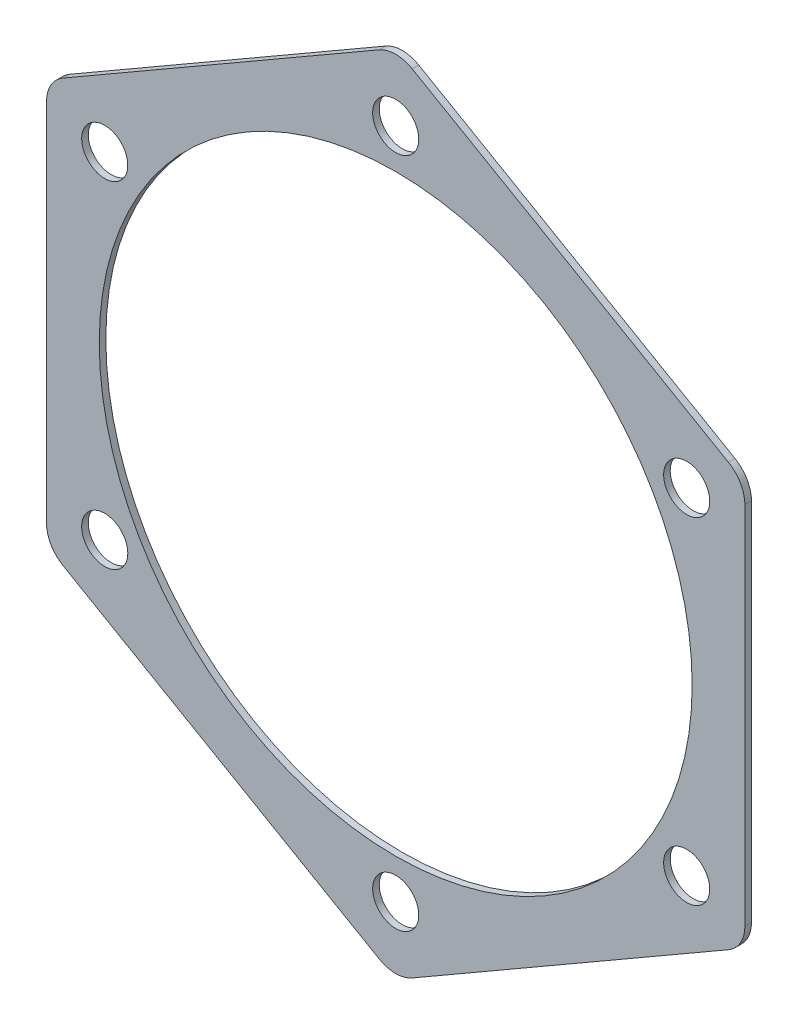
ISO-10303-21;
HEADER;
FILE_DESCRIPTION(('STEP AP214'),'2;1');
FILE_NAME('part.step','',(''),(''),'','','');
FILE_SCHEMA(('AUTOMOTIVE_DESIGN { 1 0 10303 214 1 1 1 1 }'));
ENDSEC;
DATA;
#1=APPLICATION_CONTEXT('core data for automotive mechanical design processes');
#2=APPLICATION_PROTOCOL_DEFINITION('international standard','automotive_design',2000,#1);
#3=PRODUCT_CONTEXT('',#1,'mechanical');
#4=PRODUCT('Part','Part','',(#3));
#5=PRODUCT_RELATED_PRODUCT_CATEGORY('part','',(#4));
#6=PRODUCT_DEFINITION_FORMATION('','',#4);
#7=PRODUCT_DEFINITION_CONTEXT('part definition',#1,'design');
#8=PRODUCT_DEFINITION('design','',#6,#7);
#9=PRODUCT_DEFINITION_SHAPE('','',#8);
#10=(LENGTH_UNIT() NAMED_UNIT(*) SI_UNIT(.MILLI.,.METRE.));
#11=(NAMED_UNIT(*) PLANE_ANGLE_UNIT() SI_UNIT($,.RADIAN.));
#12=(NAMED_UNIT(*) SI_UNIT($,.STERADIAN.) SOLID_ANGLE_UNIT());
#13=UNCERTAINTY_MEASURE_WITH_UNIT(LENGTH_MEASURE(1.E-05),#10,'distance_accuracy_value','');
#14=(GEOMETRIC_REPRESENTATION_CONTEXT(3) GLOBAL_UNCERTAINTY_ASSIGNED_CONTEXT((#13)) GLOBAL_UNIT_ASSIGNED_CONTEXT((#10,
#11,#12)) REPRESENTATION_CONTEXT('',''));
#15=CARTESIAN_POINT('',(0.,0.,0.));
#16=DIRECTION('',(0.,0.,1.));
#17=DIRECTION('',(1.,0.,0.));
#18=AXIS2_PLACEMENT_3D('',#15,#16,#17);
#19=CARTESIAN_POINT('',(52.9999999999997,30.5995642670508,0.5));
#20=DIRECTION('',(-0.499999999999995,-0.866025403784442,0.));
#21=DIRECTION('',(0.866025403784442,-0.499999999999995,0.));
#22=AXIS2_PLACEMENT_3D('',#19,#20,#21);
#23=PLANE('',#22);
#24=DIRECTION('',(-0.866025403784442,0.499999999999995,0.));
#25=VECTOR('',#24,1.);
#26=CARTESIAN_POINT('',(52.9999999999997,30.5995642670508,0.5));
#27=LINE('',#26,#25);
#28=CARTESIAN_POINT('',(50.4999999999997,32.0429399400248,0.5));
#29=VERTEX_POINT('',#28);
#30=CARTESIAN_POINT('',(2.49999999999998,59.7557528611263,0.5));
#31=VERTEX_POINT('',#30);
#32=EDGE_CURVE('E154',#29,#31,#27,.T.);
#33=ORIENTED_EDGE('',*,*,#32,.F.);
#34=DIRECTION('',(0.,0.,-1.));
#35=VECTOR('',#34,1.);
#36=CARTESIAN_POINT('',(50.4999999999997,32.0429399400248,0.5));
#37=LINE('',#36,#35);
#38=CARTESIAN_POINT('',(50.4999999999997,32.0429399400248,-0.5));
#39=VERTEX_POINT('',#38);
#40=EDGE_CURVE('E138',#29,#39,#37,.T.);
#41=ORIENTED_EDGE('',*,*,#40,.T.);
#42=DIRECTION('',(-0.866025403784442,0.499999999999995,0.));
#43=VECTOR('',#42,1.);
#44=CARTESIAN_POINT('',(52.9999999999997,30.5995642670508,-0.5));
#45=LINE('',#44,#43);
#46=CARTESIAN_POINT('',(2.49999999999998,59.7557528611263,-0.5));
#47=VERTEX_POINT('',#46);
#48=EDGE_CURVE('E151',#39,#47,#45,.T.);
#49=ORIENTED_EDGE('',*,*,#48,.T.);
#50=DIRECTION('',(0.,0.,-1.));
#51=VECTOR('',#50,1.);
#52=CARTESIAN_POINT('',(2.49999999999999,59.7557528611263,0.5));
#53=LINE('',#52,#51);
#54=EDGE_CURVE('E157',#47,#31,#53,.F.);
#55=ORIENTED_EDGE('',*,*,#54,.T.);
#56=EDGE_LOOP('',(#33,#41,#49,#55));
#57=FACE_BOUND('',#56,.T.);
#58=ADVANCED_FACE('F43',(#57),#23,.F.);
#59=CARTESIAN_POINT('',(0.,61.1991285341004,0.5));
#60=DIRECTION('',(0.500000000000001,-0.866025403784438,0.));
#61=DIRECTION('',(0.866025403784438,0.500000000000001,0.));
#62=AXIS2_PLACEMENT_3D('',#59,#60,#61);
#63=PLANE('',#62);
#64=DIRECTION('',(-0.866025403784438,-0.500000000000001,0.));
#65=VECTOR('',#64,1.);
#66=CARTESIAN_POINT('',(0.,61.1991285341004,-0.5));
#67=LINE('',#66,#65);
#68=CARTESIAN_POINT('',(-2.49999999999998,59.7557528611263,-0.5));
#69=VERTEX_POINT('',#68);
#70=CARTESIAN_POINT('',(-50.5000000000001,32.0429399400241,-0.5));
#71=VERTEX_POINT('',#70);
#72=EDGE_CURVE('E162',#69,#71,#67,.T.);
#73=ORIENTED_EDGE('',*,*,#72,.T.);
#74=DIRECTION('',(0.,0.,-1.));
#75=VECTOR('',#74,1.);
#76=CARTESIAN_POINT('',(-50.5000000000001,32.0429399400241,0.5));
#77=LINE('',#76,#75);
#78=CARTESIAN_POINT('',(-50.5000000000001,32.0429399400241,0.5));
#79=VERTEX_POINT('',#78);
#80=EDGE_CURVE('E11',#71,#79,#77,.F.);
#81=ORIENTED_EDGE('',*,*,#80,.T.);
#82=DIRECTION('',(-0.866025403784438,-0.500000000000001,0.));
#83=VECTOR('',#82,1.);
#84=CARTESIAN_POINT('',(0.,61.1991285341004,0.5));
#85=LINE('',#84,#83);
#86=CARTESIAN_POINT('',(-2.49999999999998,59.7557528611263,0.5));
#87=VERTEX_POINT('',#86);
#88=EDGE_CURVE('E256',#87,#79,#85,.T.);
#89=ORIENTED_EDGE('',*,*,#88,.F.);
#90=DIRECTION('',(0.,0.,-1.));
#91=VECTOR('',#90,1.);
#92=CARTESIAN_POINT('',(-2.49999999999998,59.7557528611263,0.5));
#93=LINE('',#92,#91);
#94=EDGE_CURVE('E52',#87,#69,#93,.T.);
#95=ORIENTED_EDGE('',*,*,#94,.T.);
#96=EDGE_LOOP('',(#73,#81,#89,#95));
#97=FACE_BOUND('',#96,.T.);
#98=ADVANCED_FACE('F253',(#97),#63,.F.);
#99=CARTESIAN_POINT('',(-53.0000000000001,30.5995642670501,0.5));
#100=DIRECTION('',(1.,0.,0.));
#101=DIRECTION('',(0.,1.,0.));
#102=AXIS2_PLACEMENT_3D('',#99,#100,#101);
#103=PLANE('',#102);
#104=DIRECTION('',(0.,-1.,0.));
#105=VECTOR('',#104,1.);
#106=CARTESIAN_POINT('',(-53.0000000000001,30.5995642670501,-0.5));
#107=LINE('',#106,#105);
#108=CARTESIAN_POINT('',(-53.0000000000001,27.7128129211019,-0.5));
#109=VERTEX_POINT('',#108);
#110=CARTESIAN_POINT('',(-52.9999999999999,-27.7128129211023,-0.5));
#111=VERTEX_POINT('',#110);
#112=EDGE_CURVE('E169',#109,#111,#107,.T.);
#113=ORIENTED_EDGE('',*,*,#112,.T.);
#114=DIRECTION('',(0.,0.,-1.));
#115=VECTOR('',#114,1.);
#116=CARTESIAN_POINT('',(-52.9999999999999,-27.7128129211023,0.5));
#117=LINE('',#116,#115);
#118=CARTESIAN_POINT('',(-52.9999999999999,-27.7128129211023,0.5));
#119=VERTEX_POINT('',#118);
#120=EDGE_CURVE('E245',#111,#119,#117,.F.);
#121=ORIENTED_EDGE('',*,*,#120,.T.);
#122=DIRECTION('',(0.,-1.,0.));
#123=VECTOR('',#122,1.);
#124=CARTESIAN_POINT('',(-53.0000000000001,30.5995642670501,0.5));
#125=LINE('',#124,#123);
#126=CARTESIAN_POINT('',(-53.0000000000001,27.7128129211019,0.5));
#127=VERTEX_POINT('',#126);
#128=EDGE_CURVE('E269',#127,#119,#125,.T.);
#129=ORIENTED_EDGE('',*,*,#128,.F.);
#130=DIRECTION('',(0.,0.,-1.));
#131=VECTOR('',#130,1.);
#132=CARTESIAN_POINT('',(-53.0000000000001,27.7128129211019,0.5));
#133=LINE('',#132,#131);
#134=EDGE_CURVE('E241',#127,#109,#133,.T.);
#135=ORIENTED_EDGE('',*,*,#134,.T.);
#136=EDGE_LOOP('',(#113,#121,#129,#135));
#137=FACE_BOUND('',#136,.T.);
#138=ADVANCED_FACE('F266',(#137),#103,.F.);
#139=CARTESIAN_POINT('',(-52.9999999999999,-30.5995642670504,0.5));
#140=DIRECTION('',(0.499999999999995,0.866025403784441,0.));
#141=DIRECTION('',(-0.866025403784442,0.499999999999995,0.));
#142=AXIS2_PLACEMENT_3D('',#139,#140,#141);
#143=PLANE('',#142);
#144=DIRECTION('',(0.866025403784441,-0.499999999999995,0.));
#145=VECTOR('',#144,1.);
#146=CARTESIAN_POINT('',(-52.9999999999999,-30.5995642670504,-0.5));
#147=LINE('',#146,#145);
#148=CARTESIAN_POINT('',(-50.4999999999999,-32.0429399400245,-0.5));
#149=VERTEX_POINT('',#148);
#150=CARTESIAN_POINT('',(-2.49999999999959,-59.7557528611263,-0.5));
#151=VERTEX_POINT('',#150);
#152=EDGE_CURVE('E181',#149,#151,#147,.T.);
#153=ORIENTED_EDGE('',*,*,#152,.T.);
#154=DIRECTION('',(0.,0.,-1.));
#155=VECTOR('',#154,1.);
#156=CARTESIAN_POINT('',(-2.49999999999958,-59.7557528611263,0.5));
#157=LINE('',#156,#155);
#158=CARTESIAN_POINT('',(-2.49999999999959,-59.7557528611263,0.5));
#159=VERTEX_POINT('',#158);
#160=EDGE_CURVE('E238',#151,#159,#157,.F.);
#161=ORIENTED_EDGE('',*,*,#160,.T.);
#162=DIRECTION('',(0.866025403784441,-0.499999999999995,0.));
#163=VECTOR('',#162,1.);
#164=CARTESIAN_POINT('',(-52.9999999999999,-30.5995642670504,0.5));
#165=LINE('',#164,#163);
#166=CARTESIAN_POINT('',(-50.4999999999999,-32.0429399400245,0.5));
#167=VERTEX_POINT('',#166);
#168=EDGE_CURVE('E272',#167,#159,#165,.T.);
#169=ORIENTED_EDGE('',*,*,#168,.F.);
#170=DIRECTION('',(0.,0.,-1.));
#171=VECTOR('',#170,1.);
#172=CARTESIAN_POINT('',(-50.4999999999999,-32.0429399400245,0.5));
#173=LINE('',#172,#171);
#174=EDGE_CURVE('E234',#167,#149,#173,.T.);
#175=ORIENTED_EDGE('',*,*,#174,.T.);
#176=EDGE_LOOP('',(#153,#161,#169,#175));
#177=FACE_BOUND('',#176,.T.);
#178=ADVANCED_FACE('F302',(#177),#143,.F.);
#179=CARTESIAN_POINT('',(4.27351230460548E-13,-61.1991285341004,0.5));
#180=DIRECTION('',(-0.500000000000007,0.866025403784434,0.));
#181=DIRECTION('',(-0.866025403784434,-0.500000000000007,0.));
#182=AXIS2_PLACEMENT_3D('',#179,#180,#181);
#183=PLANE('',#182);
#184=DIRECTION('',(0.866025403784434,0.500000000000007,0.));
#185=VECTOR('',#184,1.);
#186=CARTESIAN_POINT('',(4.27351230460548E-13,-61.1991285341004,-0.5));
#187=LINE('',#186,#185);
#188=CARTESIAN_POINT('',(2.50000000000042,-59.7557528611263,-0.5));
#189=VERTEX_POINT('',#188);
#190=CARTESIAN_POINT('',(50.5000000000003,-32.0429399400238,-0.5));
#191=VERTEX_POINT('',#190);
#192=EDGE_CURVE('E185',#189,#191,#187,.T.);
#193=ORIENTED_EDGE('',*,*,#192,.T.);
#194=DIRECTION('',(0.,0.,-1.));
#195=VECTOR('',#194,1.);
#196=CARTESIAN_POINT('',(50.5000000000003,-32.0429399400238,0.5));
#197=LINE('',#196,#195);
#198=CARTESIAN_POINT('',(50.5000000000003,-32.0429399400238,0.5));
#199=VERTEX_POINT('',#198);
#200=EDGE_CURVE('E59',#191,#199,#197,.F.);
#201=ORIENTED_EDGE('',*,*,#200,.T.);
#202=DIRECTION('',(0.866025403784434,0.500000000000007,0.));
#203=VECTOR('',#202,1.);
#204=CARTESIAN_POINT('',(4.27351230460548E-13,-61.1991285341004,0.5));
#205=LINE('',#204,#203);
#206=CARTESIAN_POINT('',(2.50000000000042,-59.7557528611263,0.5));
#207=VERTEX_POINT('',#206);
#208=EDGE_CURVE('E277',#207,#199,#205,.T.);
#209=ORIENTED_EDGE('',*,*,#208,.F.);
#210=DIRECTION('',(0.,0.,-1.));
#211=VECTOR('',#210,1.);
#212=CARTESIAN_POINT('',(2.50000000000042,-59.7557528611263,0.5));
#213=LINE('',#212,#211);
#214=EDGE_CURVE('E228',#207,#189,#213,.T.);
#215=ORIENTED_EDGE('',*,*,#214,.T.);
#216=EDGE_LOOP('',(#193,#201,#209,#215));
#217=FACE_BOUND('',#216,.T.);
#218=ADVANCED_FACE('F295',(#217),#183,.F.);
#219=CARTESIAN_POINT('',(53.0000000000003,-30.5995642670497,0.5));
#220=DIRECTION('',(-1.,0.,0.));
#221=DIRECTION('',(0.,-1.,0.));
#222=AXIS2_PLACEMENT_3D('',#219,#220,#221);
#223=PLANE('',#222);
#224=DIRECTION('',(0.,1.,0.));
#225=VECTOR('',#224,1.);
#226=CARTESIAN_POINT('',(53.0000000000003,-30.5995642670497,-0.5));
#227=LINE('',#226,#225);
#228=CARTESIAN_POINT('',(53.0000000000003,-27.7128129211015,-0.5));
#229=VERTEX_POINT('',#228);
#230=CARTESIAN_POINT('',(52.9999999999997,27.7128129211027,-0.5));
#231=VERTEX_POINT('',#230);
#232=EDGE_CURVE('E188',#229,#231,#227,.T.);
#233=ORIENTED_EDGE('',*,*,#232,.T.);
#234=DIRECTION('',(0.,0.,-1.));
#235=VECTOR('',#234,1.);
#236=CARTESIAN_POINT('',(52.9999999999997,27.7128129211027,0.5));
#237=LINE('',#236,#235);
#238=CARTESIAN_POINT('',(52.9999999999997,27.7128129211027,0.5));
#239=VERTEX_POINT('',#238);
#240=EDGE_CURVE('E139',#231,#239,#237,.F.);
#241=ORIENTED_EDGE('',*,*,#240,.T.);
#242=DIRECTION('',(0.,1.,0.));
#243=VECTOR('',#242,1.);
#244=CARTESIAN_POINT('',(53.0000000000003,-30.5995642670497,0.5));
#245=LINE('',#244,#243);
#246=CARTESIAN_POINT('',(53.0000000000003,-27.7128129211015,0.5));
#247=VERTEX_POINT('',#246);
#248=EDGE_CURVE('E175',#247,#239,#245,.T.);
#249=ORIENTED_EDGE('',*,*,#248,.F.);
#250=DIRECTION('',(0.,0.,-1.));
#251=VECTOR('',#250,1.);
#252=CARTESIAN_POINT('',(53.0000000000003,-27.7128129211015,0.5));
#253=LINE('',#252,#251);
#254=EDGE_CURVE('E145',#247,#229,#253,.T.);
#255=ORIENTED_EDGE('',*,*,#254,.T.);
#256=EDGE_LOOP('',(#233,#241,#249,#255));
#257=FACE_BOUND('',#256,.T.);
#258=ADVANCED_FACE('F291',(#257),#223,.F.);
#259=CARTESIAN_POINT('',(0.,0.,0.5));
#260=DIRECTION('',(0.,0.,1.));
#261=DIRECTION('',(1.,0.,0.));
#262=AXIS2_PLACEMENT_3D('',#259,#260,#261);
#263=PLANE('',#262);
#264=CARTESIAN_POINT('',(44.1672955930061,25.5000000000005,0.5));
#265=DIRECTION('',(0.,0.,1.));
#266=DIRECTION('',(0.50000000000001,-0.866025403784433,0.));
#267=AXIS2_PLACEMENT_3D('',#264,#265,#266);
#268=CIRCLE('',#267,3.5);
#269=CARTESIAN_POINT('',(45.9172955930061,22.468911086755,0.5));
#270=VERTEX_POINT('',#269);
#271=EDGE_CURVE('E381',#270,#270,#268,.T.);
#272=ORIENTED_EDGE('',*,*,#271,.F.);
#273=EDGE_LOOP('',(#272));
#274=FACE_BOUND('',#273,.T.);
#275=CARTESIAN_POINT('',(44.1672955930066,-25.4999999999996,0.5));
#276=DIRECTION('',(0.,0.,1.));
#277=DIRECTION('',(-0.499999999999992,-0.866025403784443,0.));
#278=AXIS2_PLACEMENT_3D('',#275,#276,#277);
#279=CIRCLE('',#278,3.5);
#280=CARTESIAN_POINT('',(42.4172955930066,-28.5310889132451,0.5));
#281=VERTEX_POINT('',#280);
#282=EDGE_CURVE('E389',#281,#281,#279,.T.);
#283=ORIENTED_EDGE('',*,*,#282,.F.);
#284=EDGE_LOOP('',(#283));
#285=FACE_BOUND('',#284,.T.);
#286=CARTESIAN_POINT('',(0.,-51.,0.5));
#287=DIRECTION('',(0.,0.,1.));
#288=DIRECTION('',(-1.,0.,0.));
#289=AXIS2_PLACEMENT_3D('',#286,#287,#288);
#290=CIRCLE('',#289,3.5);
#291=CARTESIAN_POINT('',(-3.5,-51.,0.5));
#292=VERTEX_POINT('',#291);
#293=EDGE_CURVE('E397',#292,#292,#290,.T.);
#294=ORIENTED_EDGE('',*,*,#293,.F.);
#295=EDGE_LOOP('',(#294));
#296=FACE_BOUND('',#295,.T.);
#297=CARTESIAN_POINT('',(-44.1672955930063,-25.5000000000002,0.5));
#298=DIRECTION('',(0.,0.,1.));
#299=DIRECTION('',(-0.500000000000004,0.866025403784436,0.));
#300=AXIS2_PLACEMENT_3D('',#297,#298,#299);
#301=CIRCLE('',#300,3.5);
#302=CARTESIAN_POINT('',(-45.9172955930063,-22.4689110867547,0.5));
#303=VERTEX_POINT('',#302);
#304=EDGE_CURVE('E405',#303,#303,#301,.T.);
#305=ORIENTED_EDGE('',*,*,#304,.F.);
#306=EDGE_LOOP('',(#305));
#307=FACE_BOUND('',#306,.T.);
#308=CARTESIAN_POINT('',(-44.1672955930064,25.4999999999999,0.5));
#309=DIRECTION('',(0.,0.,1.));
#310=DIRECTION('',(0.499999999999998,0.86602540378444,0.));
#311=AXIS2_PLACEMENT_3D('',#308,#309,#310);
#312=CIRCLE('',#311,3.5);
#313=CARTESIAN_POINT('',(-42.4172955930064,28.5310889132454,0.5));
#314=VERTEX_POINT('',#313);
#315=EDGE_CURVE('E373',#314,#314,#312,.T.);
#316=ORIENTED_EDGE('',*,*,#315,.F.);
#317=EDGE_LOOP('',(#316));
#318=FACE_BOUND('',#317,.T.);
#319=CARTESIAN_POINT('',(0.,51.,0.5));
#320=DIRECTION('',(0.,0.,1.));
#321=DIRECTION('',(1.,0.,0.));
#322=AXIS2_PLACEMENT_3D('',#319,#320,#321);
#323=CIRCLE('',#322,3.5);
#324=CARTESIAN_POINT('',(3.5,51.,0.5));
#325=VERTEX_POINT('',#324);
#326=EDGE_CURVE('E365',#325,#325,#323,.T.);
#327=ORIENTED_EDGE('',*,*,#326,.F.);
#328=EDGE_LOOP('',(#327));
#329=FACE_BOUND('',#328,.T.);
#330=CARTESIAN_POINT('',(0.,0.,0.5));
#331=DIRECTION('',(0.,0.,1.));
#332=DIRECTION('',(1.,0.,0.));
#333=AXIS2_PLACEMENT_3D('',#330,#331,#332);
#334=CIRCLE('',#333,45.);
#335=CARTESIAN_POINT('',(45.,0.,0.5));
#336=VERTEX_POINT('',#335);
#337=EDGE_CURVE('E172',#336,#336,#334,.T.);
#338=ORIENTED_EDGE('',*,*,#337,.F.);
#339=EDGE_LOOP('',(#338));
#340=FACE_BOUND('',#339,.T.);
#341=ORIENTED_EDGE('',*,*,#248,.T.);
#342=CARTESIAN_POINT('',(47.9999999999997,27.7128129211026,0.5));
#343=DIRECTION('',(0.,0.,1.));
#344=DIRECTION('',(1.,0.,0.));
#345=AXIS2_PLACEMENT_3D('',#342,#343,#344);
#346=CIRCLE('',#345,5.);
#347=EDGE_CURVE('E225',#239,#29,#346,.T.);
#348=ORIENTED_EDGE('',*,*,#347,.T.);
#349=ORIENTED_EDGE('',*,*,#32,.T.);
#350=CARTESIAN_POINT('',(0.,55.4256258422041,0.5));
#351=DIRECTION('',(0.,0.,1.));
#352=DIRECTION('',(1.,0.,0.));
#353=AXIS2_PLACEMENT_3D('',#350,#351,#352);
#354=CIRCLE('',#353,5.);
#355=EDGE_CURVE('E211',#31,#87,#354,.T.);
#356=ORIENTED_EDGE('',*,*,#355,.T.);
#357=ORIENTED_EDGE('',*,*,#88,.T.);
#358=CARTESIAN_POINT('',(-48.0000000000001,27.7128129211019,0.5));
#359=DIRECTION('',(0.,0.,1.));
#360=DIRECTION('',(1.,0.,0.));
#361=AXIS2_PLACEMENT_3D('',#358,#359,#360);
#362=CIRCLE('',#361,5.);
#363=EDGE_CURVE('E214',#79,#127,#362,.T.);
#364=ORIENTED_EDGE('',*,*,#363,.T.);
#365=ORIENTED_EDGE('',*,*,#128,.T.);
#366=CARTESIAN_POINT('',(-47.9999999999999,-27.7128129211023,0.5));
#367=DIRECTION('',(0.,0.,1.));
#368=DIRECTION('',(1.,0.,0.));
#369=AXIS2_PLACEMENT_3D('',#366,#367,#368);
#370=CIRCLE('',#369,5.);
#371=EDGE_CURVE('E217',#119,#167,#370,.T.);
#372=ORIENTED_EDGE('',*,*,#371,.T.);
#373=ORIENTED_EDGE('',*,*,#168,.T.);
#374=CARTESIAN_POINT('',(3.88144377749811E-13,-55.4256258422041,0.5));
#375=DIRECTION('',(0.,0.,1.));
#376=DIRECTION('',(1.,0.,0.));
#377=AXIS2_PLACEMENT_3D('',#374,#375,#376);
#378=CIRCLE('',#377,5.);
#379=EDGE_CURVE('E66',#159,#207,#378,.T.);
#380=ORIENTED_EDGE('',*,*,#379,.T.);
#381=ORIENTED_EDGE('',*,*,#208,.T.);
#382=CARTESIAN_POINT('',(48.0000000000003,-27.7128129211016,0.5));
#383=DIRECTION('',(0.,0.,1.));
#384=DIRECTION('',(1.,0.,0.));
#385=AXIS2_PLACEMENT_3D('',#382,#383,#384);
#386=CIRCLE('',#385,5.);
#387=EDGE_CURVE('E222',#199,#247,#386,.T.);
#388=ORIENTED_EDGE('',*,*,#387,.T.);
#389=EDGE_LOOP('',(#341,#348,#349,#356,#357,#364,#365,#372,#373,#380,#381,#388));
#390=FACE_BOUND('',#389,.T.);
#391=ADVANCED_FACE('F288',(#274,#285,#296,#307,#318,#329,#340,#390),#263,.T.);
#392=CARTESIAN_POINT('',(0.,0.,-0.5));
#393=DIRECTION('',(0.,0.,1.));
#394=DIRECTION('',(1.,0.,0.));
#395=AXIS2_PLACEMENT_3D('',#392,#393,#394);
#396=PLANE('',#395);
#397=CARTESIAN_POINT('',(44.1672955930061,25.5000000000005,-0.5));
#398=DIRECTION('',(0.,0.,1.));
#399=DIRECTION('',(0.50000000000001,-0.866025403784433,0.));
#400=AXIS2_PLACEMENT_3D('',#397,#398,#399);
#401=CIRCLE('',#400,3.5);
#402=CARTESIAN_POINT('',(45.9172955930061,22.468911086755,-0.5));
#403=VERTEX_POINT('',#402);
#404=EDGE_CURVE('E385',#403,#403,#401,.T.);
#405=ORIENTED_EDGE('',*,*,#404,.T.);
#406=EDGE_LOOP('',(#405));
#407=FACE_BOUND('',#406,.T.);
#408=CARTESIAN_POINT('',(44.1672955930066,-25.4999999999996,-0.5));
#409=DIRECTION('',(0.,0.,1.));
#410=DIRECTION('',(-0.499999999999992,-0.866025403784443,0.));
#411=AXIS2_PLACEMENT_3D('',#408,#409,#410);
#412=CIRCLE('',#411,3.5);
#413=CARTESIAN_POINT('',(42.4172955930066,-28.5310889132451,-0.5));
#414=VERTEX_POINT('',#413);
#415=EDGE_CURVE('E393',#414,#414,#412,.T.);
#416=ORIENTED_EDGE('',*,*,#415,.T.);
#417=EDGE_LOOP('',(#416));
#418=FACE_BOUND('',#417,.T.);
#419=CARTESIAN_POINT('',(0.,-51.,-0.5));
#420=DIRECTION('',(0.,0.,1.));
#421=DIRECTION('',(-1.,0.,0.));
#422=AXIS2_PLACEMENT_3D('',#419,#420,#421);
#423=CIRCLE('',#422,3.5);
#424=CARTESIAN_POINT('',(-3.5,-51.,-0.5));
#425=VERTEX_POINT('',#424);
#426=EDGE_CURVE('E401',#425,#425,#423,.T.);
#427=ORIENTED_EDGE('',*,*,#426,.T.);
#428=EDGE_LOOP('',(#427));
#429=FACE_BOUND('',#428,.T.);
#430=CARTESIAN_POINT('',(-44.1672955930063,-25.5000000000002,-0.5));
#431=DIRECTION('',(0.,0.,1.));
#432=DIRECTION('',(-0.500000000000004,0.866025403784436,0.));
#433=AXIS2_PLACEMENT_3D('',#430,#431,#432);
#434=CIRCLE('',#433,3.5);
#435=CARTESIAN_POINT('',(-45.9172955930063,-22.4689110867547,-0.5));
#436=VERTEX_POINT('',#435);
#437=EDGE_CURVE('E377',#436,#436,#434,.T.);
#438=ORIENTED_EDGE('',*,*,#437,.T.);
#439=EDGE_LOOP('',(#438));
#440=FACE_BOUND('',#439,.T.);
#441=CARTESIAN_POINT('',(-44.1672955930064,25.4999999999999,-0.5));
#442=DIRECTION('',(0.,0.,1.));
#443=DIRECTION('',(0.499999999999998,0.86602540378444,0.));
#444=AXIS2_PLACEMENT_3D('',#441,#442,#443);
#445=CIRCLE('',#444,3.5);
#446=CARTESIAN_POINT('',(-42.4172955930064,28.5310889132454,-0.5));
#447=VERTEX_POINT('',#446);
#448=EDGE_CURVE('E369',#447,#447,#445,.T.);
#449=ORIENTED_EDGE('',*,*,#448,.T.);
#450=EDGE_LOOP('',(#449));
#451=FACE_BOUND('',#450,.T.);
#452=CARTESIAN_POINT('',(0.,51.,-0.5));
#453=DIRECTION('',(0.,0.,1.));
#454=DIRECTION('',(1.,0.,0.));
#455=AXIS2_PLACEMENT_3D('',#452,#453,#454);
#456=CIRCLE('',#455,3.5);
#457=CARTESIAN_POINT('',(3.5,51.,-0.5));
#458=VERTEX_POINT('',#457);
#459=EDGE_CURVE('E363',#458,#458,#456,.T.);
#460=ORIENTED_EDGE('',*,*,#459,.T.);
#461=EDGE_LOOP('',(#460));
#462=FACE_BOUND('',#461,.T.);
#463=CARTESIAN_POINT('',(0.,0.,-0.5));
#464=DIRECTION('',(0.,0.,1.));
#465=DIRECTION('',(1.,0.,0.));
#466=AXIS2_PLACEMENT_3D('',#463,#464,#465);
#467=CIRCLE('',#466,45.);
#468=CARTESIAN_POINT('',(45.,0.,-0.5));
#469=VERTEX_POINT('',#468);
#470=EDGE_CURVE('E163',#469,#469,#467,.T.);
#471=ORIENTED_EDGE('',*,*,#470,.T.);
#472=EDGE_LOOP('',(#471));
#473=FACE_BOUND('',#472,.T.);
#474=ORIENTED_EDGE('',*,*,#48,.F.);
#475=CARTESIAN_POINT('',(47.9999999999997,27.7128129211026,-0.5));
#476=DIRECTION('',(0.,0.,1.));
#477=DIRECTION('',(1.,0.,0.));
#478=AXIS2_PLACEMENT_3D('',#475,#476,#477);
#479=CIRCLE('',#478,5.);
#480=EDGE_CURVE('E134',#39,#231,#479,.F.);
#481=ORIENTED_EDGE('',*,*,#480,.T.);
#482=ORIENTED_EDGE('',*,*,#232,.F.);
#483=CARTESIAN_POINT('',(48.0000000000003,-27.7128129211016,-0.5));
#484=DIRECTION('',(0.,0.,1.));
#485=DIRECTION('',(1.,0.,0.));
#486=AXIS2_PLACEMENT_3D('',#483,#484,#485);
#487=CIRCLE('',#486,5.);
#488=EDGE_CURVE('E146',#229,#191,#487,.F.);
#489=ORIENTED_EDGE('',*,*,#488,.T.);
#490=ORIENTED_EDGE('',*,*,#192,.F.);
#491=CARTESIAN_POINT('',(3.88144377749811E-13,-55.4256258422041,-0.5));
#492=DIRECTION('',(0.,0.,1.));
#493=DIRECTION('',(1.,0.,0.));
#494=AXIS2_PLACEMENT_3D('',#491,#492,#493);
#495=CIRCLE('',#494,5.);
#496=EDGE_CURVE('E201',#189,#151,#495,.F.);
#497=ORIENTED_EDGE('',*,*,#496,.T.);
#498=ORIENTED_EDGE('',*,*,#152,.F.);
#499=CARTESIAN_POINT('',(-47.9999999999999,-27.7128129211023,-0.5));
#500=DIRECTION('',(0.,0.,1.));
#501=DIRECTION('',(1.,0.,0.));
#502=AXIS2_PLACEMENT_3D('',#499,#500,#501);
#503=CIRCLE('',#502,5.);
#504=EDGE_CURVE('E198',#149,#111,#503,.F.);
#505=ORIENTED_EDGE('',*,*,#504,.T.);
#506=ORIENTED_EDGE('',*,*,#112,.F.);
#507=CARTESIAN_POINT('',(-48.0000000000001,27.7128129211019,-0.5));
#508=DIRECTION('',(0.,0.,1.));
#509=DIRECTION('',(1.,0.,0.));
#510=AXIS2_PLACEMENT_3D('',#507,#508,#509);
#511=CIRCLE('',#510,5.);
#512=EDGE_CURVE('E195',#109,#71,#511,.F.);
#513=ORIENTED_EDGE('',*,*,#512,.T.);
#514=ORIENTED_EDGE('',*,*,#72,.F.);
#515=CARTESIAN_POINT('',(0.,55.4256258422041,-0.5));
#516=DIRECTION('',(0.,0.,1.));
#517=DIRECTION('',(1.,0.,0.));
#518=AXIS2_PLACEMENT_3D('',#515,#516,#517);
#519=CIRCLE('',#518,5.);
#520=EDGE_CURVE('E156',#69,#47,#519,.F.);
#521=ORIENTED_EDGE('',*,*,#520,.T.);
#522=EDGE_LOOP('',(#474,#481,#482,#489,#490,#497,#498,#505,#506,#513,#514,#521));
#523=FACE_BOUND('',#522,.T.);
#524=ADVANCED_FACE('F159',(#407,#418,#429,#440,#451,#462,#473,#523),#396,.F.);
#525=CARTESIAN_POINT('',(0.,0.,-0.5));
#526=DIRECTION('',(0.,0.,1.));
#527=DIRECTION('',(1.,0.,0.));
#528=AXIS2_PLACEMENT_3D('',#525,#526,#527);
#529=CYLINDRICAL_SURFACE('',#528,45.);
#530=ORIENTED_EDGE('',*,*,#470,.F.);
#531=EDGE_LOOP('',(#530));
#532=FACE_BOUND('',#531,.T.);
#533=ORIENTED_EDGE('',*,*,#337,.T.);
#534=EDGE_LOOP('',(#533));
#535=FACE_BOUND('',#534,.T.);
#536=ADVANCED_FACE('F434',(#532,#535),#529,.F.);
#537=CARTESIAN_POINT('',(0.,51.,-0.5));
#538=DIRECTION('',(0.,0.,1.));
#539=DIRECTION('',(1.,0.,0.));
#540=AXIS2_PLACEMENT_3D('',#537,#538,#539);
#541=CYLINDRICAL_SURFACE('',#540,3.5);
#542=ORIENTED_EDGE('',*,*,#459,.F.);
#543=EDGE_LOOP('',(#542));
#544=FACE_BOUND('',#543,.T.);
#545=ORIENTED_EDGE('',*,*,#326,.T.);
#546=EDGE_LOOP('',(#545));
#547=FACE_BOUND('',#546,.T.);
#548=ADVANCED_FACE('F436',(#544,#547),#541,.F.);
#549=CARTESIAN_POINT('',(-44.1672955930064,25.4999999999999,-0.5));
#550=DIRECTION('',(0.,0.,1.));
#551=DIRECTION('',(1.,0.,0.));
#552=AXIS2_PLACEMENT_3D('',#549,#550,#551);
#553=CYLINDRICAL_SURFACE('',#552,3.5);
#554=ORIENTED_EDGE('',*,*,#448,.F.);
#555=EDGE_LOOP('',(#554));
#556=FACE_BOUND('',#555,.T.);
#557=ORIENTED_EDGE('',*,*,#315,.T.);
#558=EDGE_LOOP('',(#557));
#559=FACE_BOUND('',#558,.T.);
#560=ADVANCED_FACE('F420',(#556,#559),#553,.F.);
#561=CARTESIAN_POINT('',(-44.1672955930063,-25.5000000000002,-0.5));
#562=DIRECTION('',(0.,0.,1.));
#563=DIRECTION('',(1.,0.,0.));
#564=AXIS2_PLACEMENT_3D('',#561,#562,#563);
#565=CYLINDRICAL_SURFACE('',#564,3.5);
#566=ORIENTED_EDGE('',*,*,#437,.F.);
#567=EDGE_LOOP('',(#566));
#568=FACE_BOUND('',#567,.T.);
#569=ORIENTED_EDGE('',*,*,#304,.T.);
#570=EDGE_LOOP('',(#569));
#571=FACE_BOUND('',#570,.T.);
#572=ADVANCED_FACE('F416',(#568,#571),#565,.F.);
#573=CARTESIAN_POINT('',(0.,-51.,-0.5));
#574=DIRECTION('',(0.,0.,1.));
#575=DIRECTION('',(1.,0.,0.));
#576=AXIS2_PLACEMENT_3D('',#573,#574,#575);
#577=CYLINDRICAL_SURFACE('',#576,3.5);
#578=ORIENTED_EDGE('',*,*,#426,.F.);
#579=EDGE_LOOP('',(#578));
#580=FACE_BOUND('',#579,.T.);
#581=ORIENTED_EDGE('',*,*,#293,.T.);
#582=EDGE_LOOP('',(#581));
#583=FACE_BOUND('',#582,.T.);
#584=ADVANCED_FACE('F419',(#580,#583),#577,.F.);
#585=CARTESIAN_POINT('',(44.1672955930066,-25.4999999999996,-0.5));
#586=DIRECTION('',(0.,0.,1.));
#587=DIRECTION('',(1.,0.,0.));
#588=AXIS2_PLACEMENT_3D('',#585,#586,#587);
#589=CYLINDRICAL_SURFACE('',#588,3.5);
#590=ORIENTED_EDGE('',*,*,#415,.F.);
#591=EDGE_LOOP('',(#590));
#592=FACE_BOUND('',#591,.T.);
#593=ORIENTED_EDGE('',*,*,#282,.T.);
#594=EDGE_LOOP('',(#593));
#595=FACE_BOUND('',#594,.T.);
#596=ADVANCED_FACE('F518',(#592,#595),#589,.F.);
#597=CARTESIAN_POINT('',(44.1672955930061,25.5000000000005,-0.5));
#598=DIRECTION('',(0.,0.,1.));
#599=DIRECTION('',(1.,0.,0.));
#600=AXIS2_PLACEMENT_3D('',#597,#598,#599);
#601=CYLINDRICAL_SURFACE('',#600,3.5);
#602=ORIENTED_EDGE('',*,*,#404,.F.);
#603=EDGE_LOOP('',(#602));
#604=FACE_BOUND('',#603,.T.);
#605=ORIENTED_EDGE('',*,*,#271,.T.);
#606=EDGE_LOOP('',(#605));
#607=FACE_BOUND('',#606,.T.);
#608=ADVANCED_FACE('F325',(#604,#607),#601,.F.);
#609=CARTESIAN_POINT('',(47.9999999999997,27.7128129211026,0.5));
#610=DIRECTION('',(0.,0.,-1.));
#611=DIRECTION('',(-1.,0.,0.));
#612=AXIS2_PLACEMENT_3D('',#609,#610,#611);
#613=CYLINDRICAL_SURFACE('',#612,5.);
#614=ORIENTED_EDGE('',*,*,#347,.F.);
#615=ORIENTED_EDGE('',*,*,#240,.F.);
#616=ORIENTED_EDGE('',*,*,#480,.F.);
#617=ORIENTED_EDGE('',*,*,#40,.F.);
#618=EDGE_LOOP('',(#614,#615,#616,#617));
#619=FACE_BOUND('',#618,.T.);
#620=ADVANCED_FACE('F137',(#619),#613,.T.);
#621=CARTESIAN_POINT('',(48.0000000000003,-27.7128129211016,0.5));
#622=DIRECTION('',(0.,0.,-1.));
#623=DIRECTION('',(-1.,0.,0.));
#624=AXIS2_PLACEMENT_3D('',#621,#622,#623);
#625=CYLINDRICAL_SURFACE('',#624,5.);
#626=ORIENTED_EDGE('',*,*,#387,.F.);
#627=ORIENTED_EDGE('',*,*,#200,.F.);
#628=ORIENTED_EDGE('',*,*,#488,.F.);
#629=ORIENTED_EDGE('',*,*,#254,.F.);
#630=EDGE_LOOP('',(#626,#627,#628,#629));
#631=FACE_BOUND('',#630,.T.);
#632=ADVANCED_FACE('F293',(#631),#625,.T.);
#633=CARTESIAN_POINT('',(3.88144377749811E-13,-55.4256258422041,0.5));
#634=DIRECTION('',(0.,0.,-1.));
#635=DIRECTION('',(-1.,0.,0.));
#636=AXIS2_PLACEMENT_3D('',#633,#634,#635);
#637=CYLINDRICAL_SURFACE('',#636,5.);
#638=ORIENTED_EDGE('',*,*,#379,.F.);
#639=ORIENTED_EDGE('',*,*,#160,.F.);
#640=ORIENTED_EDGE('',*,*,#496,.F.);
#641=ORIENTED_EDGE('',*,*,#214,.F.);
#642=EDGE_LOOP('',(#638,#639,#640,#641));
#643=FACE_BOUND('',#642,.T.);
#644=ADVANCED_FACE('F298',(#643),#637,.T.);
#645=CARTESIAN_POINT('',(-47.9999999999999,-27.7128129211023,0.5));
#646=DIRECTION('',(0.,0.,-1.));
#647=DIRECTION('',(-1.,0.,0.));
#648=AXIS2_PLACEMENT_3D('',#645,#646,#647);
#649=CYLINDRICAL_SURFACE('',#648,5.);
#650=ORIENTED_EDGE('',*,*,#371,.F.);
#651=ORIENTED_EDGE('',*,*,#120,.F.);
#652=ORIENTED_EDGE('',*,*,#504,.F.);
#653=ORIENTED_EDGE('',*,*,#174,.F.);
#654=EDGE_LOOP('',(#650,#651,#652,#653));
#655=FACE_BOUND('',#654,.T.);
#656=ADVANCED_FACE('F306',(#655),#649,.T.);
#657=CARTESIAN_POINT('',(-48.0000000000001,27.7128129211019,0.5));
#658=DIRECTION('',(0.,0.,-1.));
#659=DIRECTION('',(-1.,0.,0.));
#660=AXIS2_PLACEMENT_3D('',#657,#658,#659);
#661=CYLINDRICAL_SURFACE('',#660,5.);
#662=ORIENTED_EDGE('',*,*,#363,.F.);
#663=ORIENTED_EDGE('',*,*,#80,.F.);
#664=ORIENTED_EDGE('',*,*,#512,.F.);
#665=ORIENTED_EDGE('',*,*,#134,.F.);
#666=EDGE_LOOP('',(#662,#663,#664,#665));
#667=FACE_BOUND('',#666,.T.);
#668=ADVANCED_FACE('F263',(#667),#661,.T.);
#669=CARTESIAN_POINT('',(0.,55.4256258422041,0.5));
#670=DIRECTION('',(0.,0.,-1.));
#671=DIRECTION('',(-1.,0.,0.));
#672=AXIS2_PLACEMENT_3D('',#669,#670,#671);
#673=CYLINDRICAL_SURFACE('',#672,5.);
#674=ORIENTED_EDGE('',*,*,#355,.F.);
#675=ORIENTED_EDGE('',*,*,#54,.F.);
#676=ORIENTED_EDGE('',*,*,#520,.F.);
#677=ORIENTED_EDGE('',*,*,#94,.F.);
#678=EDGE_LOOP('',(#674,#675,#676,#677));
#679=FACE_BOUND('',#678,.T.);
#680=ADVANCED_FACE('F45',(#679),#673,.T.);
#681=CLOSED_SHELL('',(#58,#98,#138,#178,#218,#258,#391,#524,#536,#548,#560,#572,#584,#596,#608,
#620,#632,#644,#656,#668,#680));
#682=MANIFOLD_SOLID_BREP('B2',#681);
#683=ADVANCED_BREP_SHAPE_REPRESENTATION('',(#18,#682),#14);
#684=SHAPE_DEFINITION_REPRESENTATION(#9,#683);
ENDSEC;
END-ISO-10303-21;
